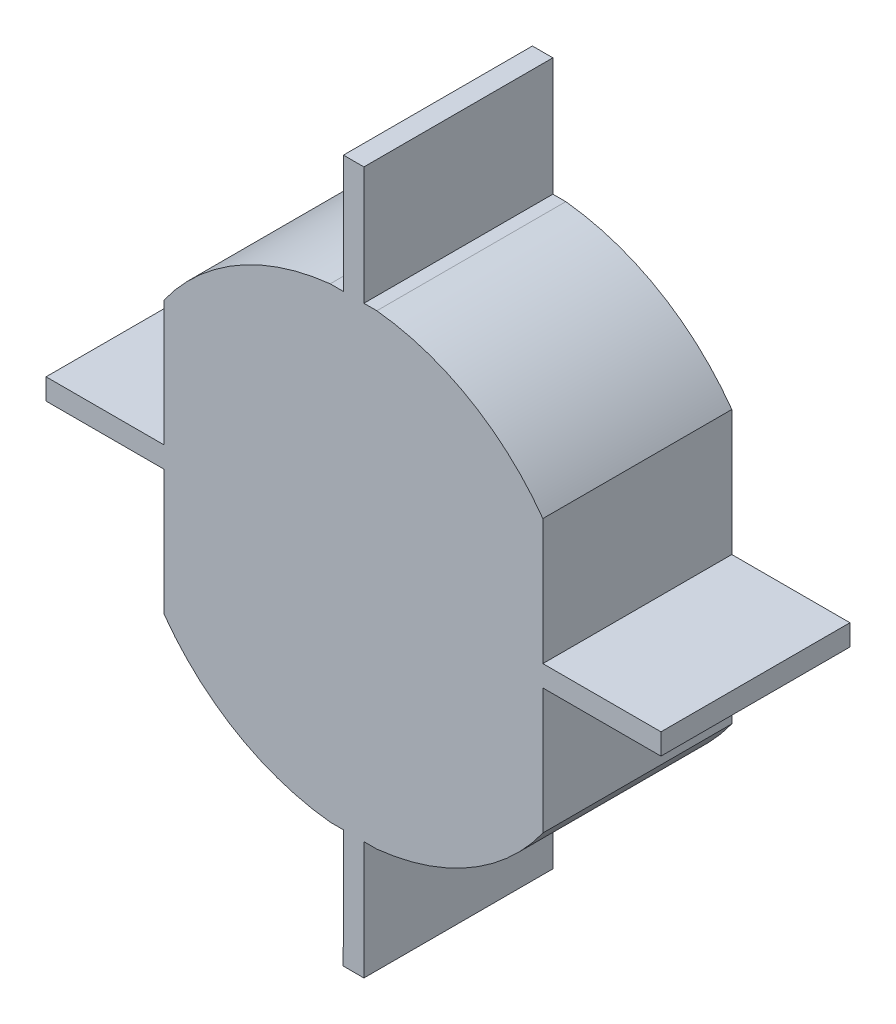
ISO-10303-21;
HEADER;
FILE_DESCRIPTION(('STEP AP214'),'2;1');
FILE_NAME('part.step','',(''),(''),'','','');
FILE_SCHEMA(('AUTOMOTIVE_DESIGN { 1 0 10303 214 1 1 1 1 }'));
ENDSEC;
DATA;
#1=APPLICATION_CONTEXT('core data for automotive mechanical design processes');
#2=APPLICATION_PROTOCOL_DEFINITION('international standard','automotive_design',2000,#1);
#3=PRODUCT_CONTEXT('',#1,'mechanical');
#4=PRODUCT('Part','Part','',(#3));
#5=PRODUCT_RELATED_PRODUCT_CATEGORY('part','',(#4));
#6=PRODUCT_DEFINITION_FORMATION('','',#4);
#7=PRODUCT_DEFINITION_CONTEXT('part definition',#1,'design');
#8=PRODUCT_DEFINITION('design','',#6,#7);
#9=PRODUCT_DEFINITION_SHAPE('','',#8);
#10=(LENGTH_UNIT() NAMED_UNIT(*) SI_UNIT(.MILLI.,.METRE.));
#11=(NAMED_UNIT(*) PLANE_ANGLE_UNIT() SI_UNIT($,.RADIAN.));
#12=(NAMED_UNIT(*) SI_UNIT($,.STERADIAN.) SOLID_ANGLE_UNIT());
#13=UNCERTAINTY_MEASURE_WITH_UNIT(LENGTH_MEASURE(1.E-05),#10,'distance_accuracy_value','');
#14=(GEOMETRIC_REPRESENTATION_CONTEXT(3) GLOBAL_UNCERTAINTY_ASSIGNED_CONTEXT((#13)) GLOBAL_UNIT_ASSIGNED_CONTEXT((#10,
#11,#12)) REPRESENTATION_CONTEXT('',''));
#15=CARTESIAN_POINT('',(0.,0.,0.));
#16=DIRECTION('',(0.,0.,1.));
#17=DIRECTION('',(1.,0.,0.));
#18=AXIS2_PLACEMENT_3D('',#15,#16,#17);
#19=CARTESIAN_POINT('',(13.3799025345534,15.1694661134385,8.));
#20=DIRECTION('',(0.,0.,1.));
#21=DIRECTION('',(1.,0.,0.));
#22=AXIS2_PLACEMENT_3D('',#19,#20,#21);
#23=PLANE('',#22);
#24=DIRECTION('',(0.,1.,0.));
#25=VECTOR('',#24,1.);
#26=CARTESIAN_POINT('',(21.3331965223345,0.,8.));
#27=LINE('',#26,#25);
#28=CARTESIAN_POINT('',(21.3331965223345,9.40545977739177,8.));
#29=VERTEX_POINT('',#28);
#30=CARTESIAN_POINT('',(21.3331965223345,14.7234449136435,8.));
#31=VERTEX_POINT('',#30);
#32=EDGE_CURVE('E286',#29,#31,#27,.T.);
#33=ORIENTED_EDGE('',*,*,#32,.T.);
#34=DIRECTION('',(1.,0.,0.));
#35=VECTOR('',#34,1.);
#36=CARTESIAN_POINT('',(23.6331965223345,14.7234449136435,8.));
#37=LINE('',#36,#35);
#38=CARTESIAN_POINT('',(26.3331965223345,14.7234449136435,8.));
#39=VERTEX_POINT('',#38);
#40=EDGE_CURVE('E357',#31,#39,#37,.T.);
#41=ORIENTED_EDGE('',*,*,#40,.T.);
#42=DIRECTION('',(0.,1.,0.));
#43=VECTOR('',#42,1.);
#44=CARTESIAN_POINT('',(26.3331965223345,15.6152277285287,8.));
#45=LINE('',#44,#43);
#46=CARTESIAN_POINT('',(26.3331965223345,15.6152277285287,8.));
#47=VERTEX_POINT('',#46);
#48=EDGE_CURVE('E359',#39,#47,#45,.T.);
#49=ORIENTED_EDGE('',*,*,#48,.T.);
#50=DIRECTION('',(-1.,0.,0.));
#51=VECTOR('',#50,1.);
#52=CARTESIAN_POINT('',(26.3331965223345,15.6152277285287,8.));
#53=LINE('',#52,#51);
#54=CARTESIAN_POINT('',(21.3327766275846,15.6152277285287,8.));
#55=VERTEX_POINT('',#54);
#56=EDGE_CURVE('E361',#47,#55,#53,.T.);
#57=ORIENTED_EDGE('',*,*,#56,.T.);
#58=DIRECTION('',(0.,1.,0.));
#59=VECTOR('',#58,1.);
#60=CARTESIAN_POINT('',(21.3327766275846,0.,8.));
#61=LINE('',#60,#59);
#62=CARTESIAN_POINT('',(21.3327766275846,20.9332128647804,8.));
#63=VERTEX_POINT('',#62);
#64=EDGE_CURVE('E312',#55,#63,#61,.T.);
#65=ORIENTED_EDGE('',*,*,#64,.T.);
#66=CARTESIAN_POINT('',(13.2528740930312,15.1694661134386,8.));
#67=DIRECTION('',(0.,0.,1.));
#68=DIRECTION('',(1.,0.,0.));
#69=AXIS2_PLACEMENT_3D('',#66,#67,#68);
#70=CIRCLE('',#69,9.92499882022594);
#71=CARTESIAN_POINT('',(14.3037613727571,25.0386726421721,8.));
#72=VERTEX_POINT('',#71);
#73=EDGE_CURVE('E321',#63,#72,#70,.T.);
#74=ORIENTED_EDGE('',*,*,#73,.T.);
#75=DIRECTION('',(-1.,0.,0.));
#76=VECTOR('',#75,1.);
#77=CARTESIAN_POINT('',(0.,25.0386726421721,8.));
#78=LINE('',#77,#76);
#79=CARTESIAN_POINT('',(13.7561794264892,25.0386726421721,8.));
#80=VERTEX_POINT('',#79);
#81=EDGE_CURVE('E318',#72,#80,#78,.T.);
#82=ORIENTED_EDGE('',*,*,#81,.T.);
#83=DIRECTION('',(0.,1.,0.));
#84=VECTOR('',#83,1.);
#85=CARTESIAN_POINT('',(13.7561794264892,27.3386726421721,8.));
#86=LINE('',#85,#84);
#87=CARTESIAN_POINT('',(13.7561794264892,30.0386729360243,8.));
#88=VERTEX_POINT('',#87);
#89=EDGE_CURVE('E363',#80,#88,#86,.T.);
#90=ORIENTED_EDGE('',*,*,#89,.T.);
#91=DIRECTION('',(-1.,0.,0.));
#92=VECTOR('',#91,1.);
#93=CARTESIAN_POINT('',(13.7561794264892,30.0386729360243,8.));
#94=LINE('',#93,#92);
#95=CARTESIAN_POINT('',(12.8899915731585,30.0386729360243,8.));
#96=VERTEX_POINT('',#95);
#97=EDGE_CURVE('E365',#88,#96,#94,.T.);
#98=ORIENTED_EDGE('',*,*,#97,.T.);
#99=DIRECTION('',(0.,-1.,0.));
#100=VECTOR('',#99,1.);
#101=CARTESIAN_POINT('',(12.8899915731585,30.0386729360243,8.));
#102=LINE('',#101,#100);
#103=CARTESIAN_POINT('',(12.8899915731585,25.0386726421721,8.));
#104=VERTEX_POINT('',#103);
#105=EDGE_CURVE('E339',#96,#104,#102,.T.);
#106=ORIENTED_EDGE('',*,*,#105,.T.);
#107=DIRECTION('',(-1.,0.,0.));
#108=VECTOR('',#107,1.);
#109=CARTESIAN_POINT('',(0.,25.0386726421721,8.));
#110=LINE('',#109,#108);
#111=CARTESIAN_POINT('',(12.3290152548276,25.0386726421721,8.));
#112=VERTEX_POINT('',#111);
#113=EDGE_CURVE('E243',#104,#112,#110,.T.);
#114=ORIENTED_EDGE('',*,*,#113,.T.);
#115=CARTESIAN_POINT('',(13.3799025345534,15.1694661134385,8.));
#116=DIRECTION('',(0.,0.,1.));
#117=DIRECTION('',(1.,0.,0.));
#118=AXIS2_PLACEMENT_3D('',#115,#116,#117);
#119=CIRCLE('',#118,9.92499882022596);
#120=CARTESIAN_POINT('',(5.30000000000002,20.9332128647804,8.));
#121=VERTEX_POINT('',#120);
#122=EDGE_CURVE('E424',#112,#121,#119,.T.);
#123=ORIENTED_EDGE('',*,*,#122,.T.);
#124=DIRECTION('',(0.,-1.,0.));
#125=VECTOR('',#124,1.);
#126=CARTESIAN_POINT('',(5.30000000000002,0.,8.));
#127=LINE('',#126,#125);
#128=CARTESIAN_POINT('',(5.30000000000002,15.6152277285287,8.));
#129=VERTEX_POINT('',#128);
#130=EDGE_CURVE('E276',#121,#129,#127,.T.);
#131=ORIENTED_EDGE('',*,*,#130,.T.);
#132=DIRECTION('',(-1.,0.,0.));
#133=VECTOR('',#132,1.);
#134=CARTESIAN_POINT('',(3.30000000000002,15.6152277285287,8.));
#135=LINE('',#134,#133);
#136=CARTESIAN_POINT('',(0.300000000000031,15.6152277285287,8.));
#137=VERTEX_POINT('',#136);
#138=EDGE_CURVE('E246',#129,#137,#135,.T.);
#139=ORIENTED_EDGE('',*,*,#138,.T.);
#140=DIRECTION('',(0.,-1.,0.));
#141=VECTOR('',#140,1.);
#142=CARTESIAN_POINT('',(0.300000000000031,15.6152277285287,8.));
#143=LINE('',#142,#141);
#144=CARTESIAN_POINT('',(0.300000000000031,14.7234449136435,8.));
#145=VERTEX_POINT('',#144);
#146=EDGE_CURVE('E343',#137,#145,#143,.T.);
#147=ORIENTED_EDGE('',*,*,#146,.T.);
#148=DIRECTION('',(1.,0.,0.));
#149=VECTOR('',#148,1.);
#150=CARTESIAN_POINT('',(0.300000000000031,14.7234449136435,8.));
#151=LINE('',#150,#149);
#152=CARTESIAN_POINT('',(5.30000000000003,14.7234449136435,8.));
#153=VERTEX_POINT('',#152);
#154=EDGE_CURVE('E345',#145,#153,#151,.T.);
#155=ORIENTED_EDGE('',*,*,#154,.T.);
#156=DIRECTION('',(0.,-1.,0.));
#157=VECTOR('',#156,1.);
#158=CARTESIAN_POINT('',(5.30000000000003,0.,8.));
#159=LINE('',#158,#157);
#160=CARTESIAN_POINT('',(5.30000000000003,9.40545977739175,8.));
#161=VERTEX_POINT('',#160);
#162=EDGE_CURVE('E265',#153,#161,#159,.T.);
#163=ORIENTED_EDGE('',*,*,#162,.T.);
#164=CARTESIAN_POINT('',(13.3799025345534,15.1692065287337,8.));
#165=DIRECTION('',(0.,0.,1.));
#166=DIRECTION('',(1.,0.,0.));
#167=AXIS2_PLACEMENT_3D('',#164,#165,#166);
#168=CIRCLE('',#167,9.92499882022597);
#169=CARTESIAN_POINT('',(12.3290152548275,5.3000000000001,8.));
#170=VERTEX_POINT('',#169);
#171=EDGE_CURVE('E262',#161,#170,#168,.T.);
#172=ORIENTED_EDGE('',*,*,#171,.T.);
#173=DIRECTION('',(1.,0.,0.));
#174=VECTOR('',#173,1.);
#175=CARTESIAN_POINT('',(0.,5.3000000000001,8.));
#176=LINE('',#175,#174);
#177=CARTESIAN_POINT('',(12.888985331852,5.3000000000001,8.));
#178=VERTEX_POINT('',#177);
#179=EDGE_CURVE('E257',#170,#178,#176,.T.);
#180=ORIENTED_EDGE('',*,*,#179,.T.);
#181=DIRECTION('',(0.00201206501272151,0.999997975795144,0.));
#182=VECTOR('',#181,1.);
#183=CARTESIAN_POINT('',(12.87826922903,-0.0259119673912696,8.));
#184=LINE('',#183,#182);
#185=CARTESIAN_POINT('',(12.8849611936809,3.3000000000001,8.));
#186=VERTEX_POINT('',#185);
#187=EDGE_CURVE('E269',#186,#178,#184,.T.);
#188=ORIENTED_EDGE('',*,*,#187,.F.);
#189=DIRECTION('',(1.,0.,0.));
#190=VECTOR('',#189,1.);
#191=CARTESIAN_POINT('',(12.227716247246,3.3000000000001,8.));
#192=LINE('',#191,#190);
#193=CARTESIAN_POINT('',(12.8899913663948,3.3000000000001,8.));
#194=VERTEX_POINT('',#193);
#195=EDGE_CURVE('E347',#186,#194,#192,.T.);
#196=ORIENTED_EDGE('',*,*,#195,.T.);
#197=DIRECTION('',(0.,-1.,0.));
#198=VECTOR('',#197,1.);
#199=CARTESIAN_POINT('',(12.8899913663948,2.99876985451196,8.));
#200=LINE('',#199,#198);
#201=CARTESIAN_POINT('',(12.8899913663948,2.99876985451196,8.));
#202=VERTEX_POINT('',#201);
#203=EDGE_CURVE('E349',#194,#202,#200,.T.);
#204=ORIENTED_EDGE('',*,*,#203,.T.);
#205=DIRECTION('',(-0.00410048496045272,-0.999991592976205,0.));
#206=VECTOR('',#205,1.);
#207=CARTESIAN_POINT('',(12.8789249654838,0.299989592616938,8.));
#208=LINE('',#207,#206);
#209=CARTESIAN_POINT('',(12.8789249654838,0.299989592616938,8.));
#210=VERTEX_POINT('',#209);
#211=EDGE_CURVE('E351',#202,#210,#208,.T.);
#212=ORIENTED_EDGE('',*,*,#211,.T.);
#213=DIRECTION('',(0.999999999929695,1.18579095884445E-05,0.));
#214=VECTOR('',#213,1.);
#215=CARTESIAN_POINT('',(12.8789249654838,0.299989592616938,8.));
#216=LINE('',#215,#214);
#217=CARTESIAN_POINT('',(13.7565993212391,0.300000000000097,8.));
#218=VERTEX_POINT('',#217);
#219=EDGE_CURVE('E353',#210,#218,#216,.T.);
#220=ORIENTED_EDGE('',*,*,#219,.T.);
#221=DIRECTION('',(0.,1.,0.));
#222=VECTOR('',#221,1.);
#223=CARTESIAN_POINT('',(13.7565993212391,0.300000000000097,8.));
#224=LINE('',#223,#222);
#225=CARTESIAN_POINT('',(13.7565993212391,5.3000000000001,8.));
#226=VERTEX_POINT('',#225);
#227=EDGE_CURVE('E355',#218,#226,#224,.T.);
#228=ORIENTED_EDGE('',*,*,#227,.T.);
#229=DIRECTION('',(1.,0.,0.));
#230=VECTOR('',#229,1.);
#231=CARTESIAN_POINT('',(0.,5.30000000000016,8.));
#232=LINE('',#231,#230);
#233=CARTESIAN_POINT('',(14.304181267507,5.30000000000009,8.));
#234=VERTEX_POINT('',#233);
#235=EDGE_CURVE('E295',#226,#234,#232,.T.);
#236=ORIENTED_EDGE('',*,*,#235,.T.);
#237=CARTESIAN_POINT('',(13.2532939877811,15.1692065287336,8.));
#238=DIRECTION('',(0.,0.,1.));
#239=DIRECTION('',(1.,0.,0.));
#240=AXIS2_PLACEMENT_3D('',#237,#238,#239);
#241=CIRCLE('',#240,9.92499882022593);
#242=EDGE_CURVE('E292',#234,#29,#241,.T.);
#243=ORIENTED_EDGE('',*,*,#242,.T.);
#244=EDGE_LOOP('',(#33,#41,#49,#57,#65,#74,#82,#90,#98,#106,#114,#123,#131,#139,#147,#155,#163,
#172,#180,#188,#196,#204,#212,#220,#228,#236,#243));
#245=FACE_BOUND('',#244,.T.);
#246=ADVANCED_FACE('F40',(#245),#23,.T.);
#247=CARTESIAN_POINT('',(13.3799025345534,15.1694661134385,0.));
#248=DIRECTION('',(0.,0.,1.));
#249=DIRECTION('',(1.,0.,0.));
#250=AXIS2_PLACEMENT_3D('',#247,#248,#249);
#251=PLANE('',#250);
#252=DIRECTION('',(1.,0.,0.));
#253=VECTOR('',#252,1.);
#254=CARTESIAN_POINT('',(23.6331965223345,14.7234449136435,0.));
#255=LINE('',#254,#253);
#256=CARTESIAN_POINT('',(21.3331965223345,14.7234449136435,0.));
#257=VERTEX_POINT('',#256);
#258=CARTESIAN_POINT('',(26.3331965223345,14.7234449136435,0.));
#259=VERTEX_POINT('',#258);
#260=EDGE_CURVE('E381',#257,#259,#255,.T.);
#261=ORIENTED_EDGE('',*,*,#260,.F.);
#262=DIRECTION('',(0.,1.,0.));
#263=VECTOR('',#262,1.);
#264=CARTESIAN_POINT('',(21.3331965223345,0.,0.));
#265=LINE('',#264,#263);
#266=CARTESIAN_POINT('',(21.3331965223345,9.40545977739177,0.));
#267=VERTEX_POINT('',#266);
#268=EDGE_CURVE('E288',#267,#257,#265,.T.);
#269=ORIENTED_EDGE('',*,*,#268,.F.);
#270=CARTESIAN_POINT('',(13.2532939877811,15.1692065287336,0.));
#271=DIRECTION('',(0.,0.,1.));
#272=DIRECTION('',(1.,0.,0.));
#273=AXIS2_PLACEMENT_3D('',#270,#271,#272);
#274=CIRCLE('',#273,9.92499882022593);
#275=CARTESIAN_POINT('',(14.304181267507,5.30000000000009,0.));
#276=VERTEX_POINT('',#275);
#277=EDGE_CURVE('E283',#276,#267,#274,.T.);
#278=ORIENTED_EDGE('',*,*,#277,.F.);
#279=DIRECTION('',(1.,0.,0.));
#280=VECTOR('',#279,1.);
#281=CARTESIAN_POINT('',(0.,5.30000000000016,0.));
#282=LINE('',#281,#280);
#283=CARTESIAN_POINT('',(13.7565993212391,5.3000000000001,0.));
#284=VERTEX_POINT('',#283);
#285=EDGE_CURVE('E285',#284,#276,#282,.T.);
#286=ORIENTED_EDGE('',*,*,#285,.F.);
#287=DIRECTION('',(0.,1.,0.));
#288=VECTOR('',#287,1.);
#289=CARTESIAN_POINT('',(13.7565993212391,3.3000000000001,0.));
#290=LINE('',#289,#288);
#291=CARTESIAN_POINT('',(13.7565993212391,0.300000000000097,0.));
#292=VERTEX_POINT('',#291);
#293=EDGE_CURVE('E55',#292,#284,#290,.T.);
#294=ORIENTED_EDGE('',*,*,#293,.F.);
#295=DIRECTION('',(0.999999999929695,1.18579095884445E-05,0.));
#296=VECTOR('',#295,1.);
#297=CARTESIAN_POINT('',(12.8789249654838,0.299989592616938,0.));
#298=LINE('',#297,#296);
#299=CARTESIAN_POINT('',(12.8789249654838,0.299989592616938,0.));
#300=VERTEX_POINT('',#299);
#301=EDGE_CURVE('E377',#300,#292,#298,.T.);
#302=ORIENTED_EDGE('',*,*,#301,.F.);
#303=DIRECTION('',(-0.00410048496045272,-0.999991592976205,0.));
#304=VECTOR('',#303,1.);
#305=CARTESIAN_POINT('',(12.8789249654838,0.299989592616938,0.));
#306=LINE('',#305,#304);
#307=CARTESIAN_POINT('',(12.8899913663948,2.99876985451196,0.));
#308=VERTEX_POINT('',#307);
#309=EDGE_CURVE('E375',#308,#300,#306,.T.);
#310=ORIENTED_EDGE('',*,*,#309,.F.);
#311=DIRECTION('',(0.,-1.,0.));
#312=VECTOR('',#311,1.);
#313=CARTESIAN_POINT('',(12.8899913663948,2.99876985451196,0.));
#314=LINE('',#313,#312);
#315=CARTESIAN_POINT('',(12.8899913663948,3.3000000000001,0.));
#316=VERTEX_POINT('',#315);
#317=EDGE_CURVE('E373',#316,#308,#314,.T.);
#318=ORIENTED_EDGE('',*,*,#317,.F.);
#319=DIRECTION('',(1.,0.,0.));
#320=VECTOR('',#319,1.);
#321=CARTESIAN_POINT('',(12.8899913663948,3.3000000000001,0.));
#322=LINE('',#321,#320);
#323=CARTESIAN_POINT('',(12.8849611936809,3.3000000000001,0.));
#324=VERTEX_POINT('',#323);
#325=EDGE_CURVE('E371',#324,#316,#322,.T.);
#326=ORIENTED_EDGE('',*,*,#325,.F.);
#327=DIRECTION('',(0.00201206501272151,0.999997975795144,0.));
#328=VECTOR('',#327,1.);
#329=CARTESIAN_POINT('',(12.9088452865484,15.1704139131648,0.));
#330=LINE('',#329,#328);
#331=CARTESIAN_POINT('',(12.888985331852,5.3000000000001,0.));
#332=VERTEX_POINT('',#331);
#333=EDGE_CURVE('E12',#324,#332,#330,.T.);
#334=ORIENTED_EDGE('',*,*,#333,.T.);
#335=DIRECTION('',(1.,0.,0.));
#336=VECTOR('',#335,1.);
#337=CARTESIAN_POINT('',(0.,5.3000000000001,0.));
#338=LINE('',#337,#336);
#339=CARTESIAN_POINT('',(12.3290152548275,5.3000000000001,0.));
#340=VERTEX_POINT('',#339);
#341=EDGE_CURVE('E259',#340,#332,#338,.T.);
#342=ORIENTED_EDGE('',*,*,#341,.F.);
#343=CARTESIAN_POINT('',(13.3799025345534,15.1692065287337,0.));
#344=DIRECTION('',(0.,0.,1.));
#345=DIRECTION('',(1.,0.,0.));
#346=AXIS2_PLACEMENT_3D('',#343,#344,#345);
#347=CIRCLE('',#346,9.92499882022597);
#348=CARTESIAN_POINT('',(5.30000000000003,9.40545977739175,0.));
#349=VERTEX_POINT('',#348);
#350=EDGE_CURVE('E254',#349,#340,#347,.T.);
#351=ORIENTED_EDGE('',*,*,#350,.F.);
#352=DIRECTION('',(0.,-1.,0.));
#353=VECTOR('',#352,1.);
#354=CARTESIAN_POINT('',(5.30000000000003,0.,0.));
#355=LINE('',#354,#353);
#356=CARTESIAN_POINT('',(5.30000000000003,14.7234449136435,0.));
#357=VERTEX_POINT('',#356);
#358=EDGE_CURVE('E256',#357,#349,#355,.T.);
#359=ORIENTED_EDGE('',*,*,#358,.F.);
#360=DIRECTION('',(1.,0.,0.));
#361=VECTOR('',#360,1.);
#362=CARTESIAN_POINT('',(3.00000000000003,14.7234449136435,0.));
#363=LINE('',#362,#361);
#364=CARTESIAN_POINT('',(0.300000000000031,14.7234449136435,0.));
#365=VERTEX_POINT('',#364);
#366=EDGE_CURVE('E63',#365,#357,#363,.T.);
#367=ORIENTED_EDGE('',*,*,#366,.F.);
#368=DIRECTION('',(0.,-1.,0.));
#369=VECTOR('',#368,1.);
#370=CARTESIAN_POINT('',(0.300000000000031,15.6152277285287,0.));
#371=LINE('',#370,#369);
#372=CARTESIAN_POINT('',(0.300000000000031,15.6152277285287,0.));
#373=VERTEX_POINT('',#372);
#374=EDGE_CURVE('E227',#373,#365,#371,.T.);
#375=ORIENTED_EDGE('',*,*,#374,.F.);
#376=DIRECTION('',(-1.,0.,0.));
#377=VECTOR('',#376,1.);
#378=CARTESIAN_POINT('',(3.00000000000002,15.6152277285287,0.));
#379=LINE('',#378,#377);
#380=CARTESIAN_POINT('',(5.30000000000002,15.6152277285287,0.));
#381=VERTEX_POINT('',#380);
#382=EDGE_CURVE('E221',#381,#373,#379,.T.);
#383=ORIENTED_EDGE('',*,*,#382,.F.);
#384=DIRECTION('',(0.,-1.,0.));
#385=VECTOR('',#384,1.);
#386=CARTESIAN_POINT('',(5.30000000000002,0.,0.));
#387=LINE('',#386,#385);
#388=CARTESIAN_POINT('',(5.30000000000002,20.9332128647804,0.));
#389=VERTEX_POINT('',#388);
#390=EDGE_CURVE('E225',#389,#381,#387,.T.);
#391=ORIENTED_EDGE('',*,*,#390,.F.);
#392=CARTESIAN_POINT('',(13.3799025345534,15.1694661134385,0.));
#393=DIRECTION('',(0.,0.,1.));
#394=DIRECTION('',(1.,0.,0.));
#395=AXIS2_PLACEMENT_3D('',#392,#393,#394);
#396=CIRCLE('',#395,9.92499882022596);
#397=CARTESIAN_POINT('',(12.3290152548276,25.0386726421721,0.));
#398=VERTEX_POINT('',#397);
#399=EDGE_CURVE('E242',#398,#389,#396,.T.);
#400=ORIENTED_EDGE('',*,*,#399,.F.);
#401=DIRECTION('',(-1.,0.,0.));
#402=VECTOR('',#401,1.);
#403=CARTESIAN_POINT('',(0.,25.0386726421721,0.));
#404=LINE('',#403,#402);
#405=CARTESIAN_POINT('',(12.8899915731585,25.0386726421721,0.));
#406=VERTEX_POINT('',#405);
#407=EDGE_CURVE('E247',#406,#398,#404,.T.);
#408=ORIENTED_EDGE('',*,*,#407,.F.);
#409=DIRECTION('',(0.,-1.,0.));
#410=VECTOR('',#409,1.);
#411=CARTESIAN_POINT('',(12.8899915731585,27.3399028083446,0.));
#412=LINE('',#411,#410);
#413=CARTESIAN_POINT('',(12.8899915731585,30.0386729360243,0.));
#414=VERTEX_POINT('',#413);
#415=EDGE_CURVE('E232',#414,#406,#412,.T.);
#416=ORIENTED_EDGE('',*,*,#415,.F.);
#417=DIRECTION('',(-1.,0.,0.));
#418=VECTOR('',#417,1.);
#419=CARTESIAN_POINT('',(13.7561794264892,30.0386729360243,0.));
#420=LINE('',#419,#418);
#421=CARTESIAN_POINT('',(13.7561794264892,30.0386729360243,0.));
#422=VERTEX_POINT('',#421);
#423=EDGE_CURVE('E341',#422,#414,#420,.T.);
#424=ORIENTED_EDGE('',*,*,#423,.F.);
#425=DIRECTION('',(0.,1.,0.));
#426=VECTOR('',#425,1.);
#427=CARTESIAN_POINT('',(13.7561794264892,27.3386726421721,0.));
#428=LINE('',#427,#426);
#429=CARTESIAN_POINT('',(13.7561794264892,25.0386726421721,0.));
#430=VERTEX_POINT('',#429);
#431=EDGE_CURVE('E388',#430,#422,#428,.T.);
#432=ORIENTED_EDGE('',*,*,#431,.F.);
#433=DIRECTION('',(-1.,0.,0.));
#434=VECTOR('',#433,1.);
#435=CARTESIAN_POINT('',(0.,25.0386726421721,0.));
#436=LINE('',#435,#434);
#437=CARTESIAN_POINT('',(14.3037613727571,25.0386726421721,0.));
#438=VERTEX_POINT('',#437);
#439=EDGE_CURVE('E308',#438,#430,#436,.T.);
#440=ORIENTED_EDGE('',*,*,#439,.F.);
#441=CARTESIAN_POINT('',(13.2528740930312,15.1694661134386,0.));
#442=DIRECTION('',(0.,0.,1.));
#443=DIRECTION('',(1.,0.,0.));
#444=AXIS2_PLACEMENT_3D('',#441,#442,#443);
#445=CIRCLE('',#444,9.92499882022594);
#446=CARTESIAN_POINT('',(21.3327766275846,20.9332128647804,0.));
#447=VERTEX_POINT('',#446);
#448=EDGE_CURVE('E311',#447,#438,#445,.T.);
#449=ORIENTED_EDGE('',*,*,#448,.F.);
#450=DIRECTION('',(0.,1.,0.));
#451=VECTOR('',#450,1.);
#452=CARTESIAN_POINT('',(21.3327766275846,0.,0.));
#453=LINE('',#452,#451);
#454=CARTESIAN_POINT('',(21.3327766275846,15.6152277285287,0.));
#455=VERTEX_POINT('',#454);
#456=EDGE_CURVE('E315',#455,#447,#453,.T.);
#457=ORIENTED_EDGE('',*,*,#456,.F.);
#458=DIRECTION('',(-1.,0.,0.));
#459=VECTOR('',#458,1.);
#460=CARTESIAN_POINT('',(23.3327766275846,15.6152277285287,0.));
#461=LINE('',#460,#459);
#462=CARTESIAN_POINT('',(26.3331965223345,15.6152277285287,0.));
#463=VERTEX_POINT('',#462);
#464=EDGE_CURVE('E386',#463,#455,#461,.T.);
#465=ORIENTED_EDGE('',*,*,#464,.F.);
#466=DIRECTION('',(0.,1.,0.));
#467=VECTOR('',#466,1.);
#468=CARTESIAN_POINT('',(26.3331965223345,15.6152277285287,0.));
#469=LINE('',#468,#467);
#470=EDGE_CURVE('E383',#259,#463,#469,.T.);
#471=ORIENTED_EDGE('',*,*,#470,.F.);
#472=EDGE_LOOP('',(#261,#269,#278,#286,#294,#302,#310,#318,#326,#334,#342,#351,#359,#367,#375,
#383,#391,#400,#408,#416,#424,#432,#440,#449,#457,#465,#471));
#473=FACE_BOUND('',#472,.T.);
#474=ADVANCED_FACE('F223',(#473),#251,.F.);
#475=CARTESIAN_POINT('',(12.8899915731585,27.3399028083446,8.));
#476=DIRECTION('',(1.,0.,0.));
#477=DIRECTION('',(0.,0.,-1.));
#478=AXIS2_PLACEMENT_3D('',#475,#476,#477);
#479=PLANE('',#478);
#480=ORIENTED_EDGE('',*,*,#415,.T.);
#481=DIRECTION('',(0.,0.,1.));
#482=VECTOR('',#481,1.);
#483=CARTESIAN_POINT('',(12.8899915731585,25.0386726421721,0.));
#484=LINE('',#483,#482);
#485=EDGE_CURVE('E322',#406,#104,#484,.T.);
#486=ORIENTED_EDGE('',*,*,#485,.T.);
#487=ORIENTED_EDGE('',*,*,#105,.F.);
#488=DIRECTION('',(0.,0.,-1.));
#489=VECTOR('',#488,1.);
#490=CARTESIAN_POINT('',(12.8899915731585,30.0386729360243,8.));
#491=LINE('',#490,#489);
#492=EDGE_CURVE('E367',#96,#414,#491,.T.);
#493=ORIENTED_EDGE('',*,*,#492,.T.);
#494=EDGE_LOOP('',(#480,#486,#487,#493));
#495=FACE_BOUND('',#494,.T.);
#496=ADVANCED_FACE('F42',(#495),#479,.F.);
#497=CARTESIAN_POINT('',(3.00000000000002,15.6152277285287,8.));
#498=DIRECTION('',(0.,-1.,0.));
#499=DIRECTION('',(0.,0.,-1.));
#500=AXIS2_PLACEMENT_3D('',#497,#498,#499);
#501=PLANE('',#500);
#502=ORIENTED_EDGE('',*,*,#382,.T.);
#503=DIRECTION('',(0.,0.,-1.));
#504=VECTOR('',#503,1.);
#505=CARTESIAN_POINT('',(0.300000000000031,15.6152277285287,8.));
#506=LINE('',#505,#504);
#507=EDGE_CURVE('E48',#137,#373,#506,.T.);
#508=ORIENTED_EDGE('',*,*,#507,.F.);
#509=ORIENTED_EDGE('',*,*,#138,.F.);
#510=DIRECTION('',(0.,0.,1.));
#511=VECTOR('',#510,1.);
#512=CARTESIAN_POINT('',(5.30000000000002,15.6152277285287,0.));
#513=LINE('',#512,#511);
#514=EDGE_CURVE('E238',#381,#129,#513,.T.);
#515=ORIENTED_EDGE('',*,*,#514,.F.);
#516=EDGE_LOOP('',(#502,#508,#509,#515));
#517=FACE_BOUND('',#516,.T.);
#518=ADVANCED_FACE('F245',(#517),#501,.F.);
#519=CARTESIAN_POINT('',(0.300000000000031,15.6152277285287,8.));
#520=DIRECTION('',(1.,0.,0.));
#521=DIRECTION('',(0.,0.,-1.));
#522=AXIS2_PLACEMENT_3D('',#519,#520,#521);
#523=PLANE('',#522);
#524=ORIENTED_EDGE('',*,*,#374,.T.);
#525=DIRECTION('',(0.,0.,-1.));
#526=VECTOR('',#525,1.);
#527=CARTESIAN_POINT('',(0.300000000000031,14.7234449136435,8.));
#528=LINE('',#527,#526);
#529=EDGE_CURVE('E414',#145,#365,#528,.T.);
#530=ORIENTED_EDGE('',*,*,#529,.F.);
#531=ORIENTED_EDGE('',*,*,#146,.F.);
#532=ORIENTED_EDGE('',*,*,#507,.T.);
#533=EDGE_LOOP('',(#524,#530,#531,#532));
#534=FACE_BOUND('',#533,.T.);
#535=ADVANCED_FACE('F417',(#534),#523,.F.);
#536=CARTESIAN_POINT('',(3.00000000000003,14.7234449136435,8.));
#537=DIRECTION('',(0.,1.,0.));
#538=DIRECTION('',(0.,0.,1.));
#539=AXIS2_PLACEMENT_3D('',#536,#537,#538);
#540=PLANE('',#539);
#541=ORIENTED_EDGE('',*,*,#366,.T.);
#542=DIRECTION('',(0.,0.,1.));
#543=VECTOR('',#542,1.);
#544=CARTESIAN_POINT('',(5.30000000000003,14.7234449136435,0.));
#545=LINE('',#544,#543);
#546=EDGE_CURVE('E280',#357,#153,#545,.T.);
#547=ORIENTED_EDGE('',*,*,#546,.T.);
#548=ORIENTED_EDGE('',*,*,#154,.F.);
#549=ORIENTED_EDGE('',*,*,#529,.T.);
#550=EDGE_LOOP('',(#541,#547,#548,#549));
#551=FACE_BOUND('',#550,.T.);
#552=ADVANCED_FACE('F528',(#551),#540,.F.);
#553=CARTESIAN_POINT('',(12.8899913663948,3.3000000000001,8.));
#554=DIRECTION('',(0.,1.,0.));
#555=DIRECTION('',(0.,0.,1.));
#556=AXIS2_PLACEMENT_3D('',#553,#554,#555);
#557=PLANE('',#556);
#558=ORIENTED_EDGE('',*,*,#195,.F.);
#559=DIRECTION('',(0.,0.,-1.));
#560=VECTOR('',#559,1.);
#561=CARTESIAN_POINT('',(12.8849611936809,3.3000000000001,8.));
#562=LINE('',#561,#560);
#563=EDGE_CURVE('E330',#186,#324,#562,.T.);
#564=ORIENTED_EDGE('',*,*,#563,.T.);
#565=ORIENTED_EDGE('',*,*,#325,.T.);
#566=DIRECTION('',(0.,0.,-1.));
#567=VECTOR('',#566,1.);
#568=CARTESIAN_POINT('',(12.8899913663948,3.3000000000001,8.));
#569=LINE('',#568,#567);
#570=EDGE_CURVE('E411',#194,#316,#569,.T.);
#571=ORIENTED_EDGE('',*,*,#570,.F.);
#572=EDGE_LOOP('',(#558,#564,#565,#571));
#573=FACE_BOUND('',#572,.T.);
#574=ADVANCED_FACE('F510',(#573),#557,.F.);
#575=CARTESIAN_POINT('',(12.8899913663948,2.99876985451196,8.));
#576=DIRECTION('',(1.,0.,0.));
#577=DIRECTION('',(0.,0.,-1.));
#578=AXIS2_PLACEMENT_3D('',#575,#576,#577);
#579=PLANE('',#578);
#580=ORIENTED_EDGE('',*,*,#317,.T.);
#581=DIRECTION('',(0.,0.,-1.));
#582=VECTOR('',#581,1.);
#583=CARTESIAN_POINT('',(12.8899913663948,2.99876985451196,8.));
#584=LINE('',#583,#582);
#585=EDGE_CURVE('E408',#202,#308,#584,.T.);
#586=ORIENTED_EDGE('',*,*,#585,.F.);
#587=ORIENTED_EDGE('',*,*,#203,.F.);
#588=ORIENTED_EDGE('',*,*,#570,.T.);
#589=EDGE_LOOP('',(#580,#586,#587,#588));
#590=FACE_BOUND('',#589,.T.);
#591=ADVANCED_FACE('F506',(#590),#579,.F.);
#592=CARTESIAN_POINT('',(12.8789249654838,0.299989592616938,8.));
#593=DIRECTION('',(0.999991592976205,-0.00410048496045272,0.));
#594=DIRECTION('',(0.00410048496045272,0.999991592976206,0.));
#595=AXIS2_PLACEMENT_3D('',#592,#593,#594);
#596=PLANE('',#595);
#597=ORIENTED_EDGE('',*,*,#309,.T.);
#598=DIRECTION('',(0.,0.,-1.));
#599=VECTOR('',#598,1.);
#600=CARTESIAN_POINT('',(12.8789249654838,0.299989592616938,8.));
#601=LINE('',#600,#599);
#602=EDGE_CURVE('E405',#210,#300,#601,.T.);
#603=ORIENTED_EDGE('',*,*,#602,.F.);
#604=ORIENTED_EDGE('',*,*,#211,.F.);
#605=ORIENTED_EDGE('',*,*,#585,.T.);
#606=EDGE_LOOP('',(#597,#603,#604,#605));
#607=FACE_BOUND('',#606,.T.);
#608=ADVANCED_FACE('F502',(#607),#596,.F.);
#609=CARTESIAN_POINT('',(12.8789249654838,0.299989592616938,8.));
#610=DIRECTION('',(-1.18579095884445E-05,0.999999999929695,0.));
#611=DIRECTION('',(-0.999999999929695,-1.18579095884445E-05,0.));
#612=AXIS2_PLACEMENT_3D('',#609,#610,#611);
#613=PLANE('',#612);
#614=ORIENTED_EDGE('',*,*,#301,.T.);
#615=DIRECTION('',(0.,0.,-1.));
#616=VECTOR('',#615,1.);
#617=CARTESIAN_POINT('',(13.7565993212391,0.300000000000097,8.));
#618=LINE('',#617,#616);
#619=EDGE_CURVE('E403',#218,#292,#618,.T.);
#620=ORIENTED_EDGE('',*,*,#619,.F.);
#621=ORIENTED_EDGE('',*,*,#219,.F.);
#622=ORIENTED_EDGE('',*,*,#602,.T.);
#623=EDGE_LOOP('',(#614,#620,#621,#622));
#624=FACE_BOUND('',#623,.T.);
#625=ADVANCED_FACE('F497',(#624),#613,.F.);
#626=CARTESIAN_POINT('',(13.7565993212391,3.3000000000001,8.));
#627=DIRECTION('',(-1.,0.,0.));
#628=DIRECTION('',(0.,0.,1.));
#629=AXIS2_PLACEMENT_3D('',#626,#627,#628);
#630=PLANE('',#629);
#631=ORIENTED_EDGE('',*,*,#293,.T.);
#632=DIRECTION('',(0.,0.,1.));
#633=VECTOR('',#632,1.);
#634=CARTESIAN_POINT('',(13.7565993212391,5.3000000000001,0.));
#635=LINE('',#634,#633);
#636=EDGE_CURVE('E305',#284,#226,#635,.T.);
#637=ORIENTED_EDGE('',*,*,#636,.T.);
#638=ORIENTED_EDGE('',*,*,#227,.F.);
#639=ORIENTED_EDGE('',*,*,#619,.T.);
#640=EDGE_LOOP('',(#631,#637,#638,#639));
#641=FACE_BOUND('',#640,.T.);
#642=ADVANCED_FACE('F491',(#641),#630,.F.);
#643=CARTESIAN_POINT('',(23.6331965223345,14.7234449136435,8.));
#644=DIRECTION('',(0.,1.,0.));
#645=DIRECTION('',(0.,0.,1.));
#646=AXIS2_PLACEMENT_3D('',#643,#644,#645);
#647=PLANE('',#646);
#648=ORIENTED_EDGE('',*,*,#260,.T.);
#649=DIRECTION('',(0.,0.,-1.));
#650=VECTOR('',#649,1.);
#651=CARTESIAN_POINT('',(26.3331965223345,14.7234449136435,8.));
#652=LINE('',#651,#650);
#653=EDGE_CURVE('E400',#39,#259,#652,.T.);
#654=ORIENTED_EDGE('',*,*,#653,.F.);
#655=ORIENTED_EDGE('',*,*,#40,.F.);
#656=DIRECTION('',(0.,0.,1.));
#657=VECTOR('',#656,1.);
#658=CARTESIAN_POINT('',(21.3331965223345,14.7234449136435,0.));
#659=LINE('',#658,#657);
#660=EDGE_CURVE('E302',#257,#31,#659,.T.);
#661=ORIENTED_EDGE('',*,*,#660,.F.);
#662=EDGE_LOOP('',(#648,#654,#655,#661));
#663=FACE_BOUND('',#662,.T.);
#664=ADVANCED_FACE('F480',(#663),#647,.F.);
#665=CARTESIAN_POINT('',(26.3331965223345,15.6152277285287,8.));
#666=DIRECTION('',(-1.,0.,0.));
#667=DIRECTION('',(0.,0.,1.));
#668=AXIS2_PLACEMENT_3D('',#665,#666,#667);
#669=PLANE('',#668);
#670=ORIENTED_EDGE('',*,*,#470,.T.);
#671=DIRECTION('',(0.,0.,-1.));
#672=VECTOR('',#671,1.);
#673=CARTESIAN_POINT('',(26.3331965223345,15.6152277285287,8.));
#674=LINE('',#673,#672);
#675=EDGE_CURVE('E397',#47,#463,#674,.T.);
#676=ORIENTED_EDGE('',*,*,#675,.F.);
#677=ORIENTED_EDGE('',*,*,#48,.F.);
#678=ORIENTED_EDGE('',*,*,#653,.T.);
#679=EDGE_LOOP('',(#670,#676,#677,#678));
#680=FACE_BOUND('',#679,.T.);
#681=ADVANCED_FACE('F471',(#680),#669,.F.);
#682=CARTESIAN_POINT('',(23.3327766275846,15.6152277285287,8.));
#683=DIRECTION('',(0.,-1.,0.));
#684=DIRECTION('',(0.,0.,-1.));
#685=AXIS2_PLACEMENT_3D('',#682,#683,#684);
#686=PLANE('',#685);
#687=ORIENTED_EDGE('',*,*,#464,.T.);
#688=DIRECTION('',(0.,0.,1.));
#689=VECTOR('',#688,1.);
#690=CARTESIAN_POINT('',(21.3327766275846,15.6152277285287,0.));
#691=LINE('',#690,#689);
#692=EDGE_CURVE('E327',#455,#55,#691,.T.);
#693=ORIENTED_EDGE('',*,*,#692,.T.);
#694=ORIENTED_EDGE('',*,*,#56,.F.);
#695=ORIENTED_EDGE('',*,*,#675,.T.);
#696=EDGE_LOOP('',(#687,#693,#694,#695));
#697=FACE_BOUND('',#696,.T.);
#698=ADVANCED_FACE('F467',(#697),#686,.F.);
#699=CARTESIAN_POINT('',(13.7561794264892,27.3386726421721,8.));
#700=DIRECTION('',(-1.,0.,0.));
#701=DIRECTION('',(0.,0.,1.));
#702=AXIS2_PLACEMENT_3D('',#699,#700,#701);
#703=PLANE('',#702);
#704=ORIENTED_EDGE('',*,*,#431,.T.);
#705=DIRECTION('',(0.,0.,-1.));
#706=VECTOR('',#705,1.);
#707=CARTESIAN_POINT('',(13.7561794264892,30.0386729360243,8.));
#708=LINE('',#707,#706);
#709=EDGE_CURVE('E394',#88,#422,#708,.T.);
#710=ORIENTED_EDGE('',*,*,#709,.F.);
#711=ORIENTED_EDGE('',*,*,#89,.F.);
#712=DIRECTION('',(0.,0.,1.));
#713=VECTOR('',#712,1.);
#714=CARTESIAN_POINT('',(13.7561794264892,25.0386726421721,0.));
#715=LINE('',#714,#713);
#716=EDGE_CURVE('E317',#430,#80,#715,.T.);
#717=ORIENTED_EDGE('',*,*,#716,.F.);
#718=EDGE_LOOP('',(#704,#710,#711,#717));
#719=FACE_BOUND('',#718,.T.);
#720=ADVANCED_FACE('F448',(#719),#703,.F.);
#721=CARTESIAN_POINT('',(13.7561794264892,30.0386729360243,8.));
#722=DIRECTION('',(0.,-1.,0.));
#723=DIRECTION('',(0.,0.,-1.));
#724=AXIS2_PLACEMENT_3D('',#721,#722,#723);
#725=PLANE('',#724);
#726=ORIENTED_EDGE('',*,*,#423,.T.);
#727=ORIENTED_EDGE('',*,*,#492,.F.);
#728=ORIENTED_EDGE('',*,*,#97,.F.);
#729=ORIENTED_EDGE('',*,*,#709,.T.);
#730=EDGE_LOOP('',(#726,#727,#728,#729));
#731=FACE_BOUND('',#730,.T.);
#732=ADVANCED_FACE('F445',(#731),#725,.F.);
#733=CARTESIAN_POINT('',(21.3327766275846,0.,0.));
#734=DIRECTION('',(1.,0.,0.));
#735=DIRECTION('',(0.,0.,-1.));
#736=AXIS2_PLACEMENT_3D('',#733,#734,#735);
#737=PLANE('',#736);
#738=ORIENTED_EDGE('',*,*,#64,.F.);
#739=ORIENTED_EDGE('',*,*,#692,.F.);
#740=ORIENTED_EDGE('',*,*,#456,.T.);
#741=DIRECTION('',(0.,0.,1.));
#742=VECTOR('',#741,1.);
#743=CARTESIAN_POINT('',(21.3327766275846,20.9332128647804,0.));
#744=LINE('',#743,#742);
#745=EDGE_CURVE('E331',#447,#63,#744,.T.);
#746=ORIENTED_EDGE('',*,*,#745,.T.);
#747=EDGE_LOOP('',(#738,#739,#740,#746));
#748=FACE_BOUND('',#747,.T.);
#749=ADVANCED_FACE('F464',(#748),#737,.T.);
#750=CARTESIAN_POINT('',(13.2528740930312,15.1694661134386,0.));
#751=DIRECTION('',(0.,0.,1.));
#752=DIRECTION('',(1.,0.,0.));
#753=AXIS2_PLACEMENT_3D('',#750,#751,#752);
#754=CYLINDRICAL_SURFACE('',#753,9.92499882022594);
#755=ORIENTED_EDGE('',*,*,#73,.F.);
#756=ORIENTED_EDGE('',*,*,#745,.F.);
#757=ORIENTED_EDGE('',*,*,#448,.T.);
#758=DIRECTION('',(0.,0.,1.));
#759=VECTOR('',#758,1.);
#760=CARTESIAN_POINT('',(14.3037613727571,25.0386726421721,0.));
#761=LINE('',#760,#759);
#762=EDGE_CURVE('E333',#438,#72,#761,.T.);
#763=ORIENTED_EDGE('',*,*,#762,.T.);
#764=EDGE_LOOP('',(#755,#756,#757,#763));
#765=FACE_BOUND('',#764,.T.);
#766=ADVANCED_FACE('F458',(#765),#754,.T.);
#767=CARTESIAN_POINT('',(0.,25.0386726421721,0.));
#768=DIRECTION('',(0.,1.,0.));
#769=DIRECTION('',(0.,0.,1.));
#770=AXIS2_PLACEMENT_3D('',#767,#768,#769);
#771=PLANE('',#770);
#772=ORIENTED_EDGE('',*,*,#81,.F.);
#773=ORIENTED_EDGE('',*,*,#762,.F.);
#774=ORIENTED_EDGE('',*,*,#439,.T.);
#775=ORIENTED_EDGE('',*,*,#716,.T.);
#776=EDGE_LOOP('',(#772,#773,#774,#775));
#777=FACE_BOUND('',#776,.T.);
#778=ADVANCED_FACE('F454',(#777),#771,.T.);
#779=CARTESIAN_POINT('',(0.,25.0386726421721,0.));
#780=DIRECTION('',(0.,1.,0.));
#781=DIRECTION('',(0.,0.,1.));
#782=AXIS2_PLACEMENT_3D('',#779,#780,#781);
#783=PLANE('',#782);
#784=ORIENTED_EDGE('',*,*,#113,.F.);
#785=ORIENTED_EDGE('',*,*,#485,.F.);
#786=ORIENTED_EDGE('',*,*,#407,.T.);
#787=DIRECTION('',(0.,0.,1.));
#788=VECTOR('',#787,1.);
#789=CARTESIAN_POINT('',(12.3290152548276,25.0386726421721,0.));
#790=LINE('',#789,#788);
#791=EDGE_CURVE('E249',#398,#112,#790,.T.);
#792=ORIENTED_EDGE('',*,*,#791,.T.);
#793=EDGE_LOOP('',(#784,#785,#786,#792));
#794=FACE_BOUND('',#793,.T.);
#795=ADVANCED_FACE('F434',(#794),#783,.T.);
#796=CARTESIAN_POINT('',(13.3799025345534,15.1694661134385,0.));
#797=DIRECTION('',(0.,0.,1.));
#798=DIRECTION('',(1.,0.,0.));
#799=AXIS2_PLACEMENT_3D('',#796,#797,#798);
#800=CYLINDRICAL_SURFACE('',#799,9.92499882022596);
#801=ORIENTED_EDGE('',*,*,#122,.F.);
#802=ORIENTED_EDGE('',*,*,#791,.F.);
#803=ORIENTED_EDGE('',*,*,#399,.T.);
#804=DIRECTION('',(0.,0.,1.));
#805=VECTOR('',#804,1.);
#806=CARTESIAN_POINT('',(5.30000000000002,20.9332128647804,0.));
#807=LINE('',#806,#805);
#808=EDGE_CURVE('E240',#389,#121,#807,.T.);
#809=ORIENTED_EDGE('',*,*,#808,.T.);
#810=EDGE_LOOP('',(#801,#802,#803,#809));
#811=FACE_BOUND('',#810,.T.);
#812=ADVANCED_FACE('F438',(#811),#800,.T.);
#813=CARTESIAN_POINT('',(5.30000000000002,0.,0.));
#814=DIRECTION('',(-1.,0.,0.));
#815=DIRECTION('',(0.,0.,1.));
#816=AXIS2_PLACEMENT_3D('',#813,#814,#815);
#817=PLANE('',#816);
#818=ORIENTED_EDGE('',*,*,#130,.F.);
#819=ORIENTED_EDGE('',*,*,#808,.F.);
#820=ORIENTED_EDGE('',*,*,#390,.T.);
#821=ORIENTED_EDGE('',*,*,#514,.T.);
#822=EDGE_LOOP('',(#818,#819,#820,#821));
#823=FACE_BOUND('',#822,.T.);
#824=ADVANCED_FACE('F237',(#823),#817,.T.);
#825=CARTESIAN_POINT('',(12.87826922903,-0.0259119673912696,0.));
#826=DIRECTION('',(0.999997975795143,-0.00201206501272151,0.));
#827=DIRECTION('',(0.00201206501272151,0.999997975795144,0.));
#828=AXIS2_PLACEMENT_3D('',#825,#826,#827);
#829=PLANE('',#828);
#830=ORIENTED_EDGE('',*,*,#187,.T.);
#831=DIRECTION('',(0.,0.,1.));
#832=VECTOR('',#831,1.);
#833=CARTESIAN_POINT('',(12.888985331852,5.3000000000001,0.));
#834=LINE('',#833,#832);
#835=EDGE_CURVE('E277',#332,#178,#834,.T.);
#836=ORIENTED_EDGE('',*,*,#835,.F.);
#837=ORIENTED_EDGE('',*,*,#333,.F.);
#838=ORIENTED_EDGE('',*,*,#563,.F.);
#839=EDGE_LOOP('',(#830,#836,#837,#838));
#840=FACE_BOUND('',#839,.T.);
#841=ADVANCED_FACE('F515',(#840),#829,.F.);
#842=CARTESIAN_POINT('',(13.3799025345534,15.1692065287337,0.));
#843=DIRECTION('',(0.,0.,1.));
#844=DIRECTION('',(1.,0.,0.));
#845=AXIS2_PLACEMENT_3D('',#842,#843,#844);
#846=CYLINDRICAL_SURFACE('',#845,9.92499882022597);
#847=ORIENTED_EDGE('',*,*,#171,.F.);
#848=DIRECTION('',(0.,0.,1.));
#849=VECTOR('',#848,1.);
#850=CARTESIAN_POINT('',(5.30000000000003,9.40545977739175,0.));
#851=LINE('',#850,#849);
#852=EDGE_CURVE('E261',#349,#161,#851,.T.);
#853=ORIENTED_EDGE('',*,*,#852,.F.);
#854=ORIENTED_EDGE('',*,*,#350,.T.);
#855=DIRECTION('',(0.,0.,1.));
#856=VECTOR('',#855,1.);
#857=CARTESIAN_POINT('',(12.3290152548275,5.3000000000001,0.));
#858=LINE('',#857,#856);
#859=EDGE_CURVE('E273',#340,#170,#858,.T.);
#860=ORIENTED_EDGE('',*,*,#859,.T.);
#861=EDGE_LOOP('',(#847,#853,#854,#860));
#862=FACE_BOUND('',#861,.T.);
#863=ADVANCED_FACE('F524',(#862),#846,.T.);
#864=CARTESIAN_POINT('',(0.,5.3000000000001,0.));
#865=DIRECTION('',(0.,-1.,0.));
#866=DIRECTION('',(0.,0.,-1.));
#867=AXIS2_PLACEMENT_3D('',#864,#865,#866);
#868=PLANE('',#867);
#869=ORIENTED_EDGE('',*,*,#179,.F.);
#870=ORIENTED_EDGE('',*,*,#859,.F.);
#871=ORIENTED_EDGE('',*,*,#341,.T.);
#872=ORIENTED_EDGE('',*,*,#835,.T.);
#873=EDGE_LOOP('',(#869,#870,#871,#872));
#874=FACE_BOUND('',#873,.T.);
#875=ADVANCED_FACE('F518',(#874),#868,.T.);
#876=CARTESIAN_POINT('',(5.30000000000003,0.,0.));
#877=DIRECTION('',(-1.,0.,0.));
#878=DIRECTION('',(0.,-1.,0.));
#879=AXIS2_PLACEMENT_3D('',#876,#877,#878);
#880=PLANE('',#879);
#881=ORIENTED_EDGE('',*,*,#162,.F.);
#882=ORIENTED_EDGE('',*,*,#546,.F.);
#883=ORIENTED_EDGE('',*,*,#358,.T.);
#884=ORIENTED_EDGE('',*,*,#852,.T.);
#885=EDGE_LOOP('',(#881,#882,#883,#884));
#886=FACE_BOUND('',#885,.T.);
#887=ADVANCED_FACE('F527',(#886),#880,.T.);
#888=CARTESIAN_POINT('',(13.2532939877811,15.1692065287336,0.));
#889=DIRECTION('',(0.,0.,1.));
#890=DIRECTION('',(1.,0.,0.));
#891=AXIS2_PLACEMENT_3D('',#888,#889,#890);
#892=CYLINDRICAL_SURFACE('',#891,9.92499882022593);
#893=ORIENTED_EDGE('',*,*,#242,.F.);
#894=DIRECTION('',(0.,0.,1.));
#895=VECTOR('',#894,1.);
#896=CARTESIAN_POINT('',(14.304181267507,5.30000000000009,0.));
#897=LINE('',#896,#895);
#898=EDGE_CURVE('E291',#276,#234,#897,.T.);
#899=ORIENTED_EDGE('',*,*,#898,.F.);
#900=ORIENTED_EDGE('',*,*,#277,.T.);
#901=DIRECTION('',(0.,0.,1.));
#902=VECTOR('',#901,1.);
#903=CARTESIAN_POINT('',(21.3331965223345,9.40545977739177,0.));
#904=LINE('',#903,#902);
#905=EDGE_CURVE('E266',#267,#29,#904,.T.);
#906=ORIENTED_EDGE('',*,*,#905,.T.);
#907=EDGE_LOOP('',(#893,#899,#900,#906));
#908=FACE_BOUND('',#907,.T.);
#909=ADVANCED_FACE('F483',(#908),#892,.T.);
#910=CARTESIAN_POINT('',(21.3331965223345,0.,0.));
#911=DIRECTION('',(1.,0.,0.));
#912=DIRECTION('',(0.,0.,-1.));
#913=AXIS2_PLACEMENT_3D('',#910,#911,#912);
#914=PLANE('',#913);
#915=ORIENTED_EDGE('',*,*,#32,.F.);
#916=ORIENTED_EDGE('',*,*,#905,.F.);
#917=ORIENTED_EDGE('',*,*,#268,.T.);
#918=ORIENTED_EDGE('',*,*,#660,.T.);
#919=EDGE_LOOP('',(#915,#916,#917,#918));
#920=FACE_BOUND('',#919,.T.);
#921=ADVANCED_FACE('F479',(#920),#914,.T.);
#922=CARTESIAN_POINT('',(0.,5.30000000000016,0.));
#923=DIRECTION('',(0.,-1.,0.));
#924=DIRECTION('',(1.,0.,0.));
#925=AXIS2_PLACEMENT_3D('',#922,#923,#924);
#926=PLANE('',#925);
#927=ORIENTED_EDGE('',*,*,#235,.F.);
#928=ORIENTED_EDGE('',*,*,#636,.F.);
#929=ORIENTED_EDGE('',*,*,#285,.T.);
#930=ORIENTED_EDGE('',*,*,#898,.T.);
#931=EDGE_LOOP('',(#927,#928,#929,#930));
#932=FACE_BOUND('',#931,.T.);
#933=ADVANCED_FACE('F489',(#932),#926,.T.);
#934=CLOSED_SHELL('',(#246,#474,#496,#518,#535,#552,#574,#591,#608,#625,#642,#664,#681,#698,
#720,#732,#749,#766,#778,#795,#812,#824,#841,#863,#875,#887,#909,#921,#933));
#935=MANIFOLD_SOLID_BREP('B2',#934);
#936=ADVANCED_BREP_SHAPE_REPRESENTATION('',(#18,#935),#14);
#937=SHAPE_DEFINITION_REPRESENTATION(#9,#936);
ENDSEC;
END-ISO-10303-21;
